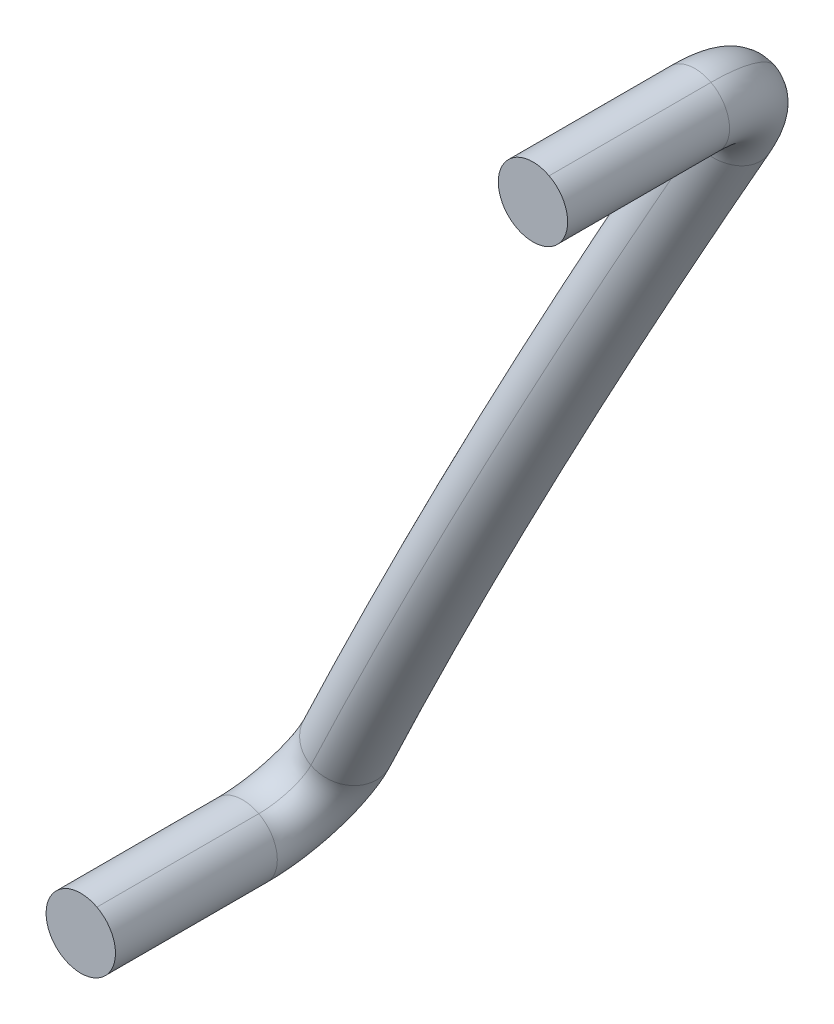
ISO-10303-21;
HEADER;
FILE_DESCRIPTION(('STEP AP214'),'2;1');
FILE_NAME('part.step','',(''),(''),'','','');
FILE_SCHEMA(('AUTOMOTIVE_DESIGN { 1 0 10303 214 1 1 1 1 }'));
ENDSEC;
DATA;
#1=APPLICATION_CONTEXT('core data for automotive mechanical design processes');
#2=APPLICATION_PROTOCOL_DEFINITION('international standard','automotive_design',2000,#1);
#3=PRODUCT_CONTEXT('',#1,'mechanical');
#4=PRODUCT('Part','Part','',(#3));
#5=PRODUCT_RELATED_PRODUCT_CATEGORY('part','',(#4));
#6=PRODUCT_DEFINITION_FORMATION('','',#4);
#7=PRODUCT_DEFINITION_CONTEXT('part definition',#1,'design');
#8=PRODUCT_DEFINITION('design','',#6,#7);
#9=PRODUCT_DEFINITION_SHAPE('','',#8);
#10=(LENGTH_UNIT() NAMED_UNIT(*) SI_UNIT(.MILLI.,.METRE.));
#11=(NAMED_UNIT(*) PLANE_ANGLE_UNIT() SI_UNIT($,.RADIAN.));
#12=(NAMED_UNIT(*) SI_UNIT($,.STERADIAN.) SOLID_ANGLE_UNIT());
#13=UNCERTAINTY_MEASURE_WITH_UNIT(LENGTH_MEASURE(1.E-05),#10,'distance_accuracy_value','');
#14=(GEOMETRIC_REPRESENTATION_CONTEXT(3) GLOBAL_UNCERTAINTY_ASSIGNED_CONTEXT((#13)) GLOBAL_UNIT_ASSIGNED_CONTEXT((#10,
#11,#12)) REPRESENTATION_CONTEXT('',''));
#15=CARTESIAN_POINT('',(0.,0.,0.));
#16=DIRECTION('',(0.,0.,1.));
#17=DIRECTION('',(1.,0.,0.));
#18=AXIS2_PLACEMENT_3D('',#15,#16,#17);
#19=CARTESIAN_POINT('',(164.637737646,-48.256580477,194.648278346));
#20=DIRECTION('',(0.,0.,1.));
#21=DIRECTION('',(-0.465643509073003,-0.884972385138757,0.));
#22=AXIS2_PLACEMENT_3D('',#19,#20,#21);
#23=CYLINDRICAL_SURFACE('',#22,0.75);
#24=DIRECTION('',(0.,0.,1.));
#25=VECTOR('',#24,1.);
#26=CARTESIAN_POINT('',(164.986970277805,-47.5928511881459,194.648278346));
#27=LINE('',#26,#25);
#28=CARTESIAN_POINT('',(164.986970277805,-47.5928511881459,194.648278346));
#29=VERTEX_POINT('',#28);
#30=CARTESIAN_POINT('',(164.986970277805,-47.5928511881459,198.148278346));
#31=VERTEX_POINT('',#30);
#32=EDGE_CURVE('E152',#29,#31,#27,.T.);
#33=ORIENTED_EDGE('',*,*,#32,.F.);
#34=CARTESIAN_POINT('',(164.637737646,-48.256580477,194.648278346));
#35=DIRECTION('',(0.,0.,-1.));
#36=DIRECTION('',(-0.465643509073003,-0.884972385138757,0.));
#37=AXIS2_PLACEMENT_3D('',#34,#35,#36);
#38=CIRCLE('',#37,0.75);
#39=CARTESIAN_POINT('',(164.288505014195,-48.9203097658541,194.648278346));
#40=VERTEX_POINT('',#39);
#41=EDGE_CURVE('E122',#40,#29,#38,.T.);
#42=ORIENTED_EDGE('',*,*,#41,.F.);
#43=DIRECTION('',(0.,0.,1.));
#44=VECTOR('',#43,1.);
#45=CARTESIAN_POINT('',(164.288505014195,-48.9203097658541,194.648278346));
#46=LINE('',#45,#44);
#47=CARTESIAN_POINT('',(164.288505014195,-48.9203097658541,198.148278346));
#48=VERTEX_POINT('',#47);
#49=EDGE_CURVE('E161',#40,#48,#46,.T.);
#50=ORIENTED_EDGE('',*,*,#49,.T.);
#51=CARTESIAN_POINT('',(164.637737646,-48.256580477,198.148278346));
#52=DIRECTION('',(0.,0.,-1.));
#53=DIRECTION('',(0.465643509073003,0.884972385138757,0.));
#54=AXIS2_PLACEMENT_3D('',#51,#52,#53);
#55=CIRCLE('',#54,0.75);
#56=EDGE_CURVE('E11',#48,#31,#55,.T.);
#57=ORIENTED_EDGE('',*,*,#56,.T.);
#58=EDGE_LOOP('',(#33,#42,#50,#57));
#59=FACE_BOUND('',#58,.T.);
#60=ADVANCED_FACE('F16',(#59),#23,.T.);
#61=CARTESIAN_POINT('',(165.336202909,-46.929121899,194.648278346));
#62=DIRECTION('',(-0.884972385138754,0.465643509073008,0.));
#63=DIRECTION('',(0.465643509073008,0.884972385138754,0.));
#64=AXIS2_PLACEMENT_3D('',#61,#62,#63);
#65=TOROIDAL_SURFACE('',#64,1.5,0.75);
#66=CARTESIAN_POINT('',(165.336202909,-46.929121899,194.648278346));
#67=DIRECTION('',(-0.884972385138756,0.465643509073004,0.));
#68=DIRECTION('',(-0.465643509073004,-0.884972385138756,0.));
#69=AXIS2_PLACEMENT_3D('',#66,#67,#68);
#70=CIRCLE('',#69,2.25);
#71=CARTESIAN_POINT('',(165.4291022247,-46.7525633661038,192.407140955479));
#72=VERTEX_POINT('',#71);
#73=EDGE_CURVE('E114',#72,#40,#70,.T.);
#74=ORIENTED_EDGE('',*,*,#73,.F.);
#75=CARTESIAN_POINT('',(165.398135789,-46.811416212,193.154186752));
#76=DIRECTION('',(0.463809368077701,0.881486534147675,0.088669950939899));
#77=DIRECTION('',(0.0412885870118005,0.07847045802245,-0.996061062284997));
#78=AXIS2_PLACEMENT_3D('',#75,#76,#77);
#79=CIRCLE('',#78,0.75);
#80=CARTESIAN_POINT('',(165.367169344043,-46.8702690530639,193.901232548906));
#81=VERTEX_POINT('',#80);
#82=EDGE_CURVE('E101',#81,#72,#79,.T.);
#83=ORIENTED_EDGE('',*,*,#82,.F.);
#84=CARTESIAN_POINT('',(165.336202909,-46.929121899,194.648278346));
#85=DIRECTION('',(-0.884972385138757,0.465643509073003,0.));
#86=DIRECTION('',(-0.465643509073003,-0.884972385138757,0.));
#87=AXIS2_PLACEMENT_3D('',#84,#85,#86);
#88=CIRCLE('',#87,0.75);
#89=EDGE_CURVE('E125',#81,#29,#88,.T.);
#90=ORIENTED_EDGE('',*,*,#89,.T.);
#91=CARTESIAN_POINT('',(164.637737646,-48.256580477,194.648278346));
#92=DIRECTION('',(0.,0.,-1.));
#93=DIRECTION('',(-0.465643509073003,-0.884972385138757,0.));
#94=AXIS2_PLACEMENT_3D('',#91,#92,#93);
#95=CIRCLE('',#94,0.75);
#96=EDGE_CURVE('E117',#29,#40,#95,.T.);
#97=ORIENTED_EDGE('',*,*,#96,.T.);
#98=EDGE_LOOP('',(#74,#83,#90,#97));
#99=FACE_BOUND('',#98,.T.);
#100=ADVANCED_FACE('F115',(#99),#65,.T.);
#101=CARTESIAN_POINT('',(169.526994485,-38.964370431,93.548080522));
#102=DIRECTION('',(0.884972385138754,-0.465643509073008,0.));
#103=DIRECTION('',(-0.465643509073008,-0.884972385138754,0.));
#104=AXIS2_PLACEMENT_3D('',#101,#102,#103);
#105=TOROIDAL_SURFACE('',#104,100.,0.75);
#106=CARTESIAN_POINT('',(169.526994485,-38.964370431,93.548080522));
#107=DIRECTION('',(0.884972385138754,-0.465643509073008,0.));
#108=DIRECTION('',(0.465643509073008,0.884972385138754,0.));
#109=AXIS2_PLACEMENT_3D('',#106,#107,#108);
#110=CIRCLE('',#109,100.75);
#111=CARTESIAN_POINT('',(173.686819625198,-31.0584718054779,193.90123254845));
#112=VERTEX_POINT('',#111);
#113=EDGE_CURVE('E106',#112,#81,#110,.T.);
#114=ORIENTED_EDGE('',*,*,#113,.F.);
#115=CARTESIAN_POINT('',(173.655853185,-31.117324649,193.154186752));
#116=DIRECTION('',(0.463809368077701,0.881486534147675,-0.088669950939899));
#117=DIRECTION('',(-0.0412885870118005,-0.07847045802245,-0.996061062284997));
#118=AXIS2_PLACEMENT_3D('',#115,#116,#117);
#119=CIRCLE('',#118,0.75);
#120=CARTESIAN_POINT('',(173.624886744541,-31.1761774924381,192.407140955023));
#121=VERTEX_POINT('',#120);
#122=EDGE_CURVE('E65',#121,#112,#119,.T.);
#123=ORIENTED_EDGE('',*,*,#122,.F.);
#124=CARTESIAN_POINT('',(169.526994485,-38.964370431,93.548080522));
#125=DIRECTION('',(0.884972385138754,-0.465643509073008,0.));
#126=DIRECTION('',(0.465643509073008,0.884972385138754,0.));
#127=AXIS2_PLACEMENT_3D('',#124,#125,#126);
#128=CIRCLE('',#127,99.25);
#129=EDGE_CURVE('E91',#121,#72,#128,.T.);
#130=ORIENTED_EDGE('',*,*,#129,.T.);
#131=CARTESIAN_POINT('',(165.398135789,-46.811416212,193.154186752));
#132=DIRECTION('',(0.463809368077701,0.881486534147675,0.088669950939899));
#133=DIRECTION('',(0.0412885870118005,0.07847045802245,-0.996061062284997));
#134=AXIS2_PLACEMENT_3D('',#131,#132,#133);
#135=CIRCLE('',#134,0.75);
#136=EDGE_CURVE('E95',#72,#81,#135,.T.);
#137=ORIENTED_EDGE('',*,*,#136,.T.);
#138=EDGE_LOOP('',(#114,#123,#130,#137));
#139=FACE_BOUND('',#138,.T.);
#140=ADVANCED_FACE('F93',(#139),#105,.T.);
#141=CARTESIAN_POINT('',(173.717786065,-30.999618963,194.648278345));
#142=DIRECTION('',(-0.884972385138754,0.465643509073008,0.));
#143=DIRECTION('',(0.465643509073008,0.884972385138754,0.));
#144=AXIS2_PLACEMENT_3D('',#141,#142,#143);
#145=TOROIDAL_SURFACE('',#144,1.5,0.75);
#146=CARTESIAN_POINT('',(173.717786065,-30.999618963,194.648278345));
#147=DIRECTION('',(-0.884972385138757,0.465643509073004,0.));
#148=DIRECTION('',(-0.465643509073004,-0.884972385138756,0.));
#149=AXIS2_PLACEMENT_3D('',#146,#147,#148);
#150=CIRCLE('',#149,2.25);
#151=CARTESIAN_POINT('',(174.765483960805,-29.008431096146,194.648278345));
#152=VERTEX_POINT('',#151);
#153=EDGE_CURVE('E134',#152,#121,#150,.T.);
#154=ORIENTED_EDGE('',*,*,#153,.F.);
#155=CARTESIAN_POINT('',(174.416251329,-29.672160385,194.648278345));
#156=DIRECTION('',(0.,0.,1.));
#157=DIRECTION('',(-0.884972385138751,0.465643509073014,0.));
#158=AXIS2_PLACEMENT_3D('',#155,#156,#157);
#159=CIRCLE('',#158,0.749999999999989);
#160=CARTESIAN_POINT('',(174.067018697195,-30.3358896738541,194.648278345));
#161=VERTEX_POINT('',#160);
#162=EDGE_CURVE('E173',#161,#152,#159,.T.);
#163=ORIENTED_EDGE('',*,*,#162,.F.);
#164=CARTESIAN_POINT('',(173.717786065,-30.999618963,194.648278345));
#165=DIRECTION('',(-0.884972385138756,0.465643509073005,0.));
#166=DIRECTION('',(-0.465643509073005,-0.884972385138756,0.));
#167=AXIS2_PLACEMENT_3D('',#164,#165,#166);
#168=CIRCLE('',#167,0.75);
#169=EDGE_CURVE('E140',#161,#112,#168,.T.);
#170=ORIENTED_EDGE('',*,*,#169,.T.);
#171=CARTESIAN_POINT('',(173.655853185,-31.117324649,193.154186752));
#172=DIRECTION('',(0.463809368077701,0.881486534147675,-0.088669950939899));
#173=DIRECTION('',(-0.0412885870118005,-0.07847045802245,-0.996061062284997));
#174=AXIS2_PLACEMENT_3D('',#171,#172,#173);
#175=CIRCLE('',#174,0.75);
#176=EDGE_CURVE('E136',#112,#121,#175,.T.);
#177=ORIENTED_EDGE('',*,*,#176,.T.);
#178=EDGE_LOOP('',(#154,#163,#170,#177));
#179=FACE_BOUND('',#178,.T.);
#180=ADVANCED_FACE('F190',(#179),#145,.T.);
#181=CARTESIAN_POINT('',(174.416251329,-29.672160385,198.148278345));
#182=DIRECTION('',(0.,0.,-1.));
#183=DIRECTION('',(0.465643509073005,0.884972385138756,0.));
#184=AXIS2_PLACEMENT_3D('',#181,#182,#183);
#185=CYLINDRICAL_SURFACE('',#184,0.75);
#186=DIRECTION('',(0.,0.,-1.));
#187=VECTOR('',#186,1.);
#188=CARTESIAN_POINT('',(174.067018697195,-30.3358896738541,198.148278345));
#189=LINE('',#188,#187);
#190=CARTESIAN_POINT('',(174.067018697195,-30.3358896738541,198.148278345));
#191=VERTEX_POINT('',#190);
#192=EDGE_CURVE('E169',#191,#161,#189,.T.);
#193=ORIENTED_EDGE('',*,*,#192,.F.);
#194=CARTESIAN_POINT('',(174.416251329,-29.672160385,198.148278345));
#195=DIRECTION('',(0.,0.,1.));
#196=DIRECTION('',(-0.884972385138751,0.465643509073014,0.));
#197=AXIS2_PLACEMENT_3D('',#194,#195,#196);
#198=CIRCLE('',#197,0.749999999999989);
#199=CARTESIAN_POINT('',(174.765483960805,-29.008431096146,198.148278345));
#200=VERTEX_POINT('',#199);
#201=EDGE_CURVE('E25',#200,#191,#198,.T.);
#202=ORIENTED_EDGE('',*,*,#201,.F.);
#203=DIRECTION('',(0.,0.,-1.));
#204=VECTOR('',#203,1.);
#205=CARTESIAN_POINT('',(174.765483960805,-29.008431096146,198.148278345));
#206=LINE('',#205,#204);
#207=EDGE_CURVE('E50',#200,#152,#206,.T.);
#208=ORIENTED_EDGE('',*,*,#207,.T.);
#209=CARTESIAN_POINT('',(174.416251329,-29.672160385,194.648278345));
#210=DIRECTION('',(0.,0.,1.));
#211=DIRECTION('',(-0.884972385138751,0.465643509073014,0.));
#212=AXIS2_PLACEMENT_3D('',#209,#210,#211);
#213=CIRCLE('',#212,0.749999999999989);
#214=EDGE_CURVE('E100',#152,#161,#213,.T.);
#215=ORIENTED_EDGE('',*,*,#214,.T.);
#216=EDGE_LOOP('',(#193,#202,#208,#215));
#217=FACE_BOUND('',#216,.T.);
#218=ADVANCED_FACE('F183',(#217),#185,.T.);
#219=CARTESIAN_POINT('',(164.637737646,-48.256580477,198.148278346));
#220=DIRECTION('',(0.,0.,-1.));
#221=DIRECTION('',(0.,-1.,0.));
#222=AXIS2_PLACEMENT_3D('',#219,#220,#221);
#223=PLANE('',#222);
#224=ORIENTED_EDGE('',*,*,#56,.F.);
#225=CARTESIAN_POINT('',(164.637737646,-48.256580477,198.148278346));
#226=DIRECTION('',(0.,0.,-1.));
#227=DIRECTION('',(0.465643509073003,0.884972385138757,0.));
#228=AXIS2_PLACEMENT_3D('',#225,#226,#227);
#229=CIRCLE('',#228,0.75);
#230=EDGE_CURVE('E157',#31,#48,#229,.T.);
#231=ORIENTED_EDGE('',*,*,#230,.F.);
#232=EDGE_LOOP('',(#224,#231));
#233=FACE_BOUND('',#232,.T.);
#234=ADVANCED_FACE('F215',(#233),#223,.F.);
#235=CARTESIAN_POINT('',(174.416251329,-29.672160385,198.148278345));
#236=DIRECTION('',(0.,0.,1.));
#237=DIRECTION('',(1.,0.,0.));
#238=AXIS2_PLACEMENT_3D('',#235,#236,#237);
#239=PLANE('',#238);
#240=ORIENTED_EDGE('',*,*,#201,.T.);
#241=CARTESIAN_POINT('',(174.416251329,-29.672160385,198.148278345));
#242=DIRECTION('',(0.,0.,1.));
#243=DIRECTION('',(-0.884972385138751,0.465643509073014,0.));
#244=AXIS2_PLACEMENT_3D('',#241,#242,#243);
#245=CIRCLE('',#244,0.749999999999989);
#246=EDGE_CURVE('E165',#191,#200,#245,.T.);
#247=ORIENTED_EDGE('',*,*,#246,.T.);
#248=EDGE_LOOP('',(#240,#247));
#249=FACE_BOUND('',#248,.T.);
#250=ADVANCED_FACE('F181',(#249),#239,.T.);
#251=CARTESIAN_POINT('',(174.416251329,-29.672160385,198.148278345));
#252=DIRECTION('',(0.,0.,-1.));
#253=DIRECTION('',(0.465643509073005,0.884972385138756,0.));
#254=AXIS2_PLACEMENT_3D('',#251,#252,#253);
#255=CYLINDRICAL_SURFACE('',#254,0.75);
#256=ORIENTED_EDGE('',*,*,#246,.F.);
#257=ORIENTED_EDGE('',*,*,#192,.T.);
#258=ORIENTED_EDGE('',*,*,#162,.T.);
#259=ORIENTED_EDGE('',*,*,#207,.F.);
#260=EDGE_LOOP('',(#256,#257,#258,#259));
#261=FACE_BOUND('',#260,.T.);
#262=ADVANCED_FACE('F187',(#261),#255,.T.);
#263=CARTESIAN_POINT('',(164.637737646,-48.256580477,194.648278346));
#264=DIRECTION('',(0.,0.,1.));
#265=DIRECTION('',(-0.465643509073003,-0.884972385138757,0.));
#266=AXIS2_PLACEMENT_3D('',#263,#264,#265);
#267=CYLINDRICAL_SURFACE('',#266,0.75);
#268=ORIENTED_EDGE('',*,*,#96,.F.);
#269=ORIENTED_EDGE('',*,*,#32,.T.);
#270=ORIENTED_EDGE('',*,*,#230,.T.);
#271=ORIENTED_EDGE('',*,*,#49,.F.);
#272=EDGE_LOOP('',(#268,#269,#270,#271));
#273=FACE_BOUND('',#272,.T.);
#274=ADVANCED_FACE('F194',(#273),#267,.T.);
#275=CARTESIAN_POINT('',(173.717786065,-30.999618963,194.648278345));
#276=DIRECTION('',(-0.884972385138754,0.465643509073008,0.));
#277=DIRECTION('',(0.465643509073008,0.884972385138754,0.));
#278=AXIS2_PLACEMENT_3D('',#275,#276,#277);
#279=TOROIDAL_SURFACE('',#278,1.5,0.75);
#280=ORIENTED_EDGE('',*,*,#214,.F.);
#281=ORIENTED_EDGE('',*,*,#153,.T.);
#282=ORIENTED_EDGE('',*,*,#122,.T.);
#283=ORIENTED_EDGE('',*,*,#169,.F.);
#284=EDGE_LOOP('',(#280,#281,#282,#283));
#285=FACE_BOUND('',#284,.T.);
#286=ADVANCED_FACE('F192',(#285),#279,.T.);
#287=CARTESIAN_POINT('',(169.526994485,-38.964370431,93.548080522));
#288=DIRECTION('',(0.884972385138754,-0.465643509073008,0.));
#289=DIRECTION('',(-0.465643509073008,-0.884972385138754,0.));
#290=AXIS2_PLACEMENT_3D('',#287,#288,#289);
#291=TOROIDAL_SURFACE('',#290,100.,0.75);
#292=ORIENTED_EDGE('',*,*,#176,.F.);
#293=ORIENTED_EDGE('',*,*,#113,.T.);
#294=ORIENTED_EDGE('',*,*,#82,.T.);
#295=ORIENTED_EDGE('',*,*,#129,.F.);
#296=EDGE_LOOP('',(#292,#293,#294,#295));
#297=FACE_BOUND('',#296,.T.);
#298=ADVANCED_FACE('F105',(#297),#291,.T.);
#299=CARTESIAN_POINT('',(165.336202909,-46.929121899,194.648278346));
#300=DIRECTION('',(-0.884972385138754,0.465643509073008,0.));
#301=DIRECTION('',(0.465643509073008,0.884972385138754,0.));
#302=AXIS2_PLACEMENT_3D('',#299,#300,#301);
#303=TOROIDAL_SURFACE('',#302,1.5,0.75);
#304=ORIENTED_EDGE('',*,*,#136,.F.);
#305=ORIENTED_EDGE('',*,*,#73,.T.);
#306=ORIENTED_EDGE('',*,*,#41,.T.);
#307=ORIENTED_EDGE('',*,*,#89,.F.);
#308=EDGE_LOOP('',(#304,#305,#306,#307));
#309=FACE_BOUND('',#308,.T.);
#310=ADVANCED_FACE('F124',(#309),#303,.T.);
#311=CLOSED_SHELL('',(#60,#100,#140,#180,#218,#234,#250,#262,#274,#286,#298,#310));
#312=MANIFOLD_SOLID_BREP('B1',#311);
#313=ADVANCED_BREP_SHAPE_REPRESENTATION('',(#18,#312),#14);
#314=SHAPE_DEFINITION_REPRESENTATION(#9,#313);
ENDSEC;
END-ISO-10303-21;
